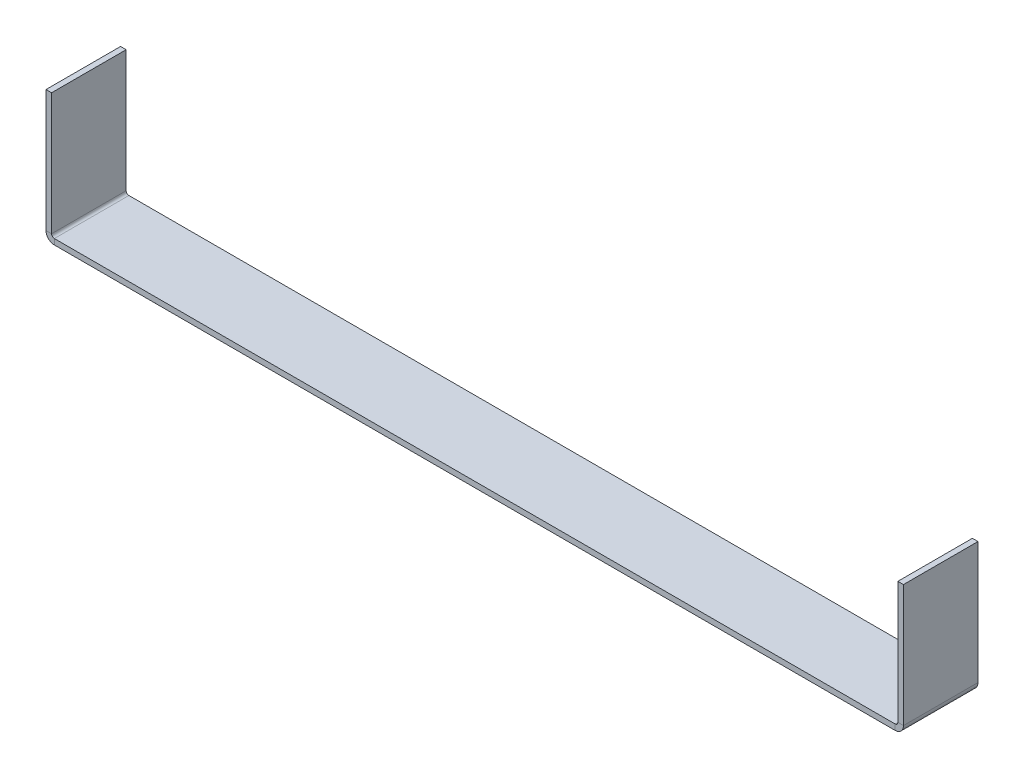
ISO-10303-21;
HEADER;
FILE_DESCRIPTION(('STEP AP214'),'2;1');
FILE_NAME('part.step','',(''),(''),'','','');
FILE_SCHEMA(('AUTOMOTIVE_DESIGN { 1 0 10303 214 1 1 1 1 }'));
ENDSEC;
DATA;
#1=APPLICATION_CONTEXT('core data for automotive mechanical design processes');
#2=APPLICATION_PROTOCOL_DEFINITION('international standard','automotive_design',2000,#1);
#3=PRODUCT_CONTEXT('',#1,'mechanical');
#4=PRODUCT('Part','Part','',(#3));
#5=PRODUCT_RELATED_PRODUCT_CATEGORY('part','',(#4));
#6=PRODUCT_DEFINITION_FORMATION('','',#4);
#7=PRODUCT_DEFINITION_CONTEXT('part definition',#1,'design');
#8=PRODUCT_DEFINITION('design','',#6,#7);
#9=PRODUCT_DEFINITION_SHAPE('','',#8);
#10=(LENGTH_UNIT() NAMED_UNIT(*) SI_UNIT(.MILLI.,.METRE.));
#11=(NAMED_UNIT(*) PLANE_ANGLE_UNIT() SI_UNIT($,.RADIAN.));
#12=(NAMED_UNIT(*) SI_UNIT($,.STERADIAN.) SOLID_ANGLE_UNIT());
#13=UNCERTAINTY_MEASURE_WITH_UNIT(LENGTH_MEASURE(1.E-05),#10,'distance_accuracy_value','');
#14=(GEOMETRIC_REPRESENTATION_CONTEXT(3) GLOBAL_UNCERTAINTY_ASSIGNED_CONTEXT((#13)) GLOBAL_UNIT_ASSIGNED_CONTEXT((#10,
#11,#12)) REPRESENTATION_CONTEXT('',''));
#15=CARTESIAN_POINT('',(0.,0.,0.));
#16=DIRECTION('',(0.,0.,1.));
#17=DIRECTION('',(1.,0.,0.));
#18=AXIS2_PLACEMENT_3D('',#15,#16,#17);
#19=CARTESIAN_POINT('',(0.,-1.5,0.));
#20=DIRECTION('',(0.,-1.,0.));
#21=DIRECTION('',(0.,0.,-1.));
#22=AXIS2_PLACEMENT_3D('',#19,#20,#21);
#23=PLANE('',#22);
#24=DIRECTION('',(-1.,0.,0.));
#25=VECTOR('',#24,1.);
#26=CARTESIAN_POINT('',(0.,-1.5,-20.));
#27=LINE('',#26,#25);
#28=CARTESIAN_POINT('',(227.7634,-1.5,-20.));
#29=VERTEX_POINT('',#28);
#30=CARTESIAN_POINT('',(2.2366,-1.5,-20.));
#31=VERTEX_POINT('',#30);
#32=EDGE_CURVE('E13',#29,#31,#27,.T.);
#33=ORIENTED_EDGE('',*,*,#32,.F.);
#34=DIRECTION('',(0.,0.,-1.));
#35=VECTOR('',#34,1.);
#36=CARTESIAN_POINT('',(227.7634,-1.5,-20.));
#37=LINE('',#36,#35);
#38=CARTESIAN_POINT('',(227.7634,-1.5,0.));
#39=VERTEX_POINT('',#38);
#40=EDGE_CURVE('E325',#29,#39,#37,.F.);
#41=ORIENTED_EDGE('',*,*,#40,.T.);
#42=DIRECTION('',(1.,0.,0.));
#43=VECTOR('',#42,1.);
#44=CARTESIAN_POINT('',(0.,-1.5,0.));
#45=LINE('',#44,#43);
#46=CARTESIAN_POINT('',(2.2366,-1.5,0.));
#47=VERTEX_POINT('',#46);
#48=EDGE_CURVE('E86',#47,#39,#45,.T.);
#49=ORIENTED_EDGE('',*,*,#48,.F.);
#50=DIRECTION('',(0.,0.,1.));
#51=VECTOR('',#50,1.);
#52=CARTESIAN_POINT('',(2.2366,-1.5,0.));
#53=LINE('',#52,#51);
#54=EDGE_CURVE('E100',#47,#31,#53,.F.);
#55=ORIENTED_EDGE('',*,*,#54,.T.);
#56=EDGE_LOOP('',(#33,#41,#49,#55));
#57=FACE_BOUND('',#56,.T.);
#58=ADVANCED_FACE('F77',(#57),#23,.T.);
#59=CARTESIAN_POINT('',(0.,0.,0.));
#60=DIRECTION('',(0.,-1.,0.));
#61=DIRECTION('',(0.,0.,-1.));
#62=AXIS2_PLACEMENT_3D('',#59,#60,#61);
#63=PLANE('',#62);
#64=DIRECTION('',(0.,0.,-1.));
#65=VECTOR('',#64,1.);
#66=CARTESIAN_POINT('',(227.7634,0.,-20.));
#67=LINE('',#66,#65);
#68=CARTESIAN_POINT('',(227.7634,0.,-20.));
#69=VERTEX_POINT('',#68);
#70=CARTESIAN_POINT('',(227.7634,0.,0.));
#71=VERTEX_POINT('',#70);
#72=EDGE_CURVE('E197',#69,#71,#67,.F.);
#73=ORIENTED_EDGE('',*,*,#72,.F.);
#74=DIRECTION('',(-1.,0.,0.));
#75=VECTOR('',#74,1.);
#76=CARTESIAN_POINT('',(0.,0.,-20.));
#77=LINE('',#76,#75);
#78=CARTESIAN_POINT('',(2.2366,0.,-20.));
#79=VERTEX_POINT('',#78);
#80=EDGE_CURVE('E81',#69,#79,#77,.T.);
#81=ORIENTED_EDGE('',*,*,#80,.T.);
#82=DIRECTION('',(0.,0.,1.));
#83=VECTOR('',#82,1.);
#84=CARTESIAN_POINT('',(2.2366,0.,0.));
#85=LINE('',#84,#83);
#86=CARTESIAN_POINT('',(2.2366,0.,0.));
#87=VERTEX_POINT('',#86);
#88=EDGE_CURVE('E144',#87,#79,#85,.F.);
#89=ORIENTED_EDGE('',*,*,#88,.F.);
#90=DIRECTION('',(1.,0.,0.));
#91=VECTOR('',#90,1.);
#92=CARTESIAN_POINT('',(0.,0.,0.));
#93=LINE('',#92,#91);
#94=EDGE_CURVE('E185',#87,#71,#93,.T.);
#95=ORIENTED_EDGE('',*,*,#94,.T.);
#96=EDGE_LOOP('',(#73,#81,#89,#95));
#97=FACE_BOUND('',#96,.T.);
#98=ADVANCED_FACE('F194',(#97),#63,.F.);
#99=CARTESIAN_POINT('',(0.,-1.5,-20.));
#100=DIRECTION('',(0.,0.,-1.));
#101=DIRECTION('',(-1.,0.,0.));
#102=AXIS2_PLACEMENT_3D('',#99,#100,#101);
#103=PLANE('',#102);
#104=ORIENTED_EDGE('',*,*,#80,.F.);
#105=DIRECTION('',(0.,-1.,0.));
#106=VECTOR('',#105,1.);
#107=CARTESIAN_POINT('',(227.7634,0.,-20.));
#108=LINE('',#107,#106);
#109=EDGE_CURVE('E331',#69,#29,#108,.T.);
#110=ORIENTED_EDGE('',*,*,#109,.T.);
#111=ORIENTED_EDGE('',*,*,#32,.T.);
#112=DIRECTION('',(0.,-1.,0.));
#113=VECTOR('',#112,1.);
#114=CARTESIAN_POINT('',(2.2366,0.,-20.));
#115=LINE('',#114,#113);
#116=EDGE_CURVE('E182',#79,#31,#115,.T.);
#117=ORIENTED_EDGE('',*,*,#116,.F.);
#118=EDGE_LOOP('',(#104,#110,#111,#117));
#119=FACE_BOUND('',#118,.T.);
#120=ADVANCED_FACE('F200',(#119),#103,.T.);
#121=CARTESIAN_POINT('',(0.,-1.5,0.));
#122=DIRECTION('',(0.,0.,1.));
#123=DIRECTION('',(1.,0.,0.));
#124=AXIS2_PLACEMENT_3D('',#121,#122,#123);
#125=PLANE('',#124);
#126=DIRECTION('',(0.,-1.,0.));
#127=VECTOR('',#126,1.);
#128=CARTESIAN_POINT('',(227.7634,0.,0.));
#129=LINE('',#128,#127);
#130=EDGE_CURVE('E173',#71,#39,#129,.T.);
#131=ORIENTED_EDGE('',*,*,#130,.F.);
#132=ORIENTED_EDGE('',*,*,#94,.F.);
#133=DIRECTION('',(0.,-1.,0.));
#134=VECTOR('',#133,1.);
#135=CARTESIAN_POINT('',(2.2366,0.,0.));
#136=LINE('',#135,#134);
#137=EDGE_CURVE('E143',#87,#47,#136,.T.);
#138=ORIENTED_EDGE('',*,*,#137,.T.);
#139=ORIENTED_EDGE('',*,*,#48,.T.);
#140=EDGE_LOOP('',(#131,#132,#138,#139));
#141=FACE_BOUND('',#140,.T.);
#142=ADVANCED_FACE('F79',(#141),#125,.T.);
#143=CARTESIAN_POINT('',(2.2366,0.7366,-20.));
#144=DIRECTION('',(0.,0.,-1.));
#145=DIRECTION('',(-1.,0.,0.));
#146=AXIS2_PLACEMENT_3D('',#143,#144,#145);
#147=PLANE('',#146);
#148=DIRECTION('',(1.,0.,0.));
#149=VECTOR('',#148,1.);
#150=CARTESIAN_POINT('',(0.,0.736599999999992,-20.));
#151=LINE('',#150,#149);
#152=CARTESIAN_POINT('',(1.5,0.736599999999997,-20.));
#153=VERTEX_POINT('',#152);
#154=CARTESIAN_POINT('',(0.,0.736599999999992,-20.));
#155=VERTEX_POINT('',#154);
#156=EDGE_CURVE('E134',#153,#155,#151,.F.);
#157=ORIENTED_EDGE('',*,*,#156,.F.);
#158=CARTESIAN_POINT('',(2.2366,0.7366,-20.));
#159=DIRECTION('',(0.,0.,1.));
#160=DIRECTION('',(1.,0.,0.));
#161=AXIS2_PLACEMENT_3D('',#158,#159,#160);
#162=CIRCLE('',#161,0.7366);
#163=EDGE_CURVE('E128',#79,#153,#162,.F.);
#164=ORIENTED_EDGE('',*,*,#163,.F.);
#165=ORIENTED_EDGE('',*,*,#116,.T.);
#166=CARTESIAN_POINT('',(2.2366,0.7366,-20.));
#167=DIRECTION('',(0.,0.,1.));
#168=DIRECTION('',(1.,0.,0.));
#169=AXIS2_PLACEMENT_3D('',#166,#167,#168);
#170=CIRCLE('',#169,2.2366);
#171=EDGE_CURVE('E175',#31,#155,#170,.F.);
#172=ORIENTED_EDGE('',*,*,#171,.T.);
#173=EDGE_LOOP('',(#157,#164,#165,#172));
#174=FACE_BOUND('',#173,.T.);
#175=ADVANCED_FACE('F199',(#174),#147,.T.);
#176=CARTESIAN_POINT('',(2.2366,0.7366,0.));
#177=DIRECTION('',(0.,0.,-1.));
#178=DIRECTION('',(-1.,0.,0.));
#179=AXIS2_PLACEMENT_3D('',#176,#177,#178);
#180=PLANE('',#179);
#181=CARTESIAN_POINT('',(2.2366,0.7366,0.));
#182=DIRECTION('',(0.,0.,1.));
#183=DIRECTION('',(1.,0.,0.));
#184=AXIS2_PLACEMENT_3D('',#181,#182,#183);
#185=CIRCLE('',#184,0.7366);
#186=CARTESIAN_POINT('',(1.5,0.736599999999997,0.));
#187=VERTEX_POINT('',#186);
#188=EDGE_CURVE('E125',#187,#87,#185,.T.);
#189=ORIENTED_EDGE('',*,*,#188,.F.);
#190=DIRECTION('',(1.,0.,0.));
#191=VECTOR('',#190,1.);
#192=CARTESIAN_POINT('',(1.5,0.736599999999997,0.));
#193=LINE('',#192,#191);
#194=CARTESIAN_POINT('',(0.,0.736599999999992,0.));
#195=VERTEX_POINT('',#194);
#196=EDGE_CURVE('E133',#187,#195,#193,.F.);
#197=ORIENTED_EDGE('',*,*,#196,.T.);
#198=CARTESIAN_POINT('',(2.2366,0.7366,0.));
#199=DIRECTION('',(0.,0.,1.));
#200=DIRECTION('',(1.,0.,0.));
#201=AXIS2_PLACEMENT_3D('',#198,#199,#200);
#202=CIRCLE('',#201,2.2366);
#203=EDGE_CURVE('E176',#195,#47,#202,.T.);
#204=ORIENTED_EDGE('',*,*,#203,.T.);
#205=ORIENTED_EDGE('',*,*,#137,.F.);
#206=EDGE_LOOP('',(#189,#197,#204,#205));
#207=FACE_BOUND('',#206,.T.);
#208=ADVANCED_FACE('F139',(#207),#180,.F.);
#209=CARTESIAN_POINT('',(2.2366,0.7366,0.));
#210=DIRECTION('',(0.,0.,1.));
#211=DIRECTION('',(-1.,0.,0.));
#212=AXIS2_PLACEMENT_3D('',#209,#210,#211);
#213=CYLINDRICAL_SURFACE('',#212,2.2366);
#214=ORIENTED_EDGE('',*,*,#54,.F.);
#215=ORIENTED_EDGE('',*,*,#203,.F.);
#216=DIRECTION('',(0.,0.,1.));
#217=VECTOR('',#216,1.);
#218=CARTESIAN_POINT('',(0.,0.736599999999992,-20.));
#219=LINE('',#218,#217);
#220=EDGE_CURVE('E157',#195,#155,#219,.F.);
#221=ORIENTED_EDGE('',*,*,#220,.T.);
#222=ORIENTED_EDGE('',*,*,#171,.F.);
#223=EDGE_LOOP('',(#214,#215,#221,#222));
#224=FACE_BOUND('',#223,.T.);
#225=ADVANCED_FACE('F216',(#224),#213,.T.);
#226=CARTESIAN_POINT('',(2.2366,0.7366,0.));
#227=DIRECTION('',(0.,0.,1.));
#228=DIRECTION('',(-1.,0.,0.));
#229=AXIS2_PLACEMENT_3D('',#226,#227,#228);
#230=CYLINDRICAL_SURFACE('',#229,0.7366);
#231=ORIENTED_EDGE('',*,*,#88,.T.);
#232=ORIENTED_EDGE('',*,*,#163,.T.);
#233=DIRECTION('',(0.,0.,1.));
#234=VECTOR('',#233,1.);
#235=CARTESIAN_POINT('',(1.5,0.736599999999997,-20.));
#236=LINE('',#235,#234);
#237=EDGE_CURVE('E121',#153,#187,#236,.T.);
#238=ORIENTED_EDGE('',*,*,#237,.T.);
#239=ORIENTED_EDGE('',*,*,#188,.T.);
#240=EDGE_LOOP('',(#231,#232,#238,#239));
#241=FACE_BOUND('',#240,.T.);
#242=ADVANCED_FACE('F124',(#241),#230,.F.);
#243=CARTESIAN_POINT('',(0.,0.,-20.));
#244=DIRECTION('',(0.,0.,1.));
#245=DIRECTION('',(1.,0.,0.));
#246=AXIS2_PLACEMENT_3D('',#243,#244,#245);
#247=PLANE('',#246);
#248=ORIENTED_EDGE('',*,*,#156,.T.);
#249=DIRECTION('',(0.,-1.,0.));
#250=VECTOR('',#249,1.);
#251=CARTESIAN_POINT('',(0.,0.,-20.));
#252=LINE('',#251,#250);
#253=CARTESIAN_POINT('',(-1.16964624851245E-13,33.5,-20.));
#254=VERTEX_POINT('',#253);
#255=EDGE_CURVE('E165',#254,#155,#252,.T.);
#256=ORIENTED_EDGE('',*,*,#255,.F.);
#257=DIRECTION('',(1.,0.,0.));
#258=VECTOR('',#257,1.);
#259=CARTESIAN_POINT('',(-1.16964624851245E-13,33.5,-20.));
#260=LINE('',#259,#258);
#261=CARTESIAN_POINT('',(1.49999999999988,33.5,-20.));
#262=VERTEX_POINT('',#261);
#263=EDGE_CURVE('E345',#254,#262,#260,.T.);
#264=ORIENTED_EDGE('',*,*,#263,.T.);
#265=DIRECTION('',(0.,1.,0.));
#266=VECTOR('',#265,1.);
#267=CARTESIAN_POINT('',(1.5,0.,-20.));
#268=LINE('',#267,#266);
#269=EDGE_CURVE('E163',#262,#153,#268,.F.);
#270=ORIENTED_EDGE('',*,*,#269,.T.);
#271=EDGE_LOOP('',(#248,#256,#264,#270));
#272=FACE_BOUND('',#271,.T.);
#273=ADVANCED_FACE('F221',(#272),#247,.F.);
#274=CARTESIAN_POINT('',(-1.16876994193937E-13,33.5,0.));
#275=DIRECTION('',(0.,0.,-1.));
#276=DIRECTION('',(-1.,0.,0.));
#277=AXIS2_PLACEMENT_3D('',#274,#275,#276);
#278=PLANE('',#277);
#279=ORIENTED_EDGE('',*,*,#196,.F.);
#280=DIRECTION('',(0.,-1.,0.));
#281=VECTOR('',#280,1.);
#282=CARTESIAN_POINT('',(1.49999999999988,33.5,0.));
#283=LINE('',#282,#281);
#284=CARTESIAN_POINT('',(1.49999999999988,33.5,0.));
#285=VERTEX_POINT('',#284);
#286=EDGE_CURVE('E153',#187,#285,#283,.F.);
#287=ORIENTED_EDGE('',*,*,#286,.T.);
#288=DIRECTION('',(1.,0.,0.));
#289=VECTOR('',#288,1.);
#290=CARTESIAN_POINT('',(-1.16876994193937E-13,33.5,0.));
#291=LINE('',#290,#289);
#292=CARTESIAN_POINT('',(-1.16964624851245E-13,33.5,0.));
#293=VERTEX_POINT('',#292);
#294=EDGE_CURVE('E145',#293,#285,#291,.T.);
#295=ORIENTED_EDGE('',*,*,#294,.F.);
#296=DIRECTION('',(0.,1.,0.));
#297=VECTOR('',#296,1.);
#298=CARTESIAN_POINT('',(0.,0.,0.));
#299=LINE('',#298,#297);
#300=EDGE_CURVE('E156',#195,#293,#299,.T.);
#301=ORIENTED_EDGE('',*,*,#300,.F.);
#302=EDGE_LOOP('',(#279,#287,#295,#301));
#303=FACE_BOUND('',#302,.T.);
#304=ADVANCED_FACE('F150',(#303),#278,.F.);
#305=CARTESIAN_POINT('',(0.,0.,0.));
#306=DIRECTION('',(1.,0.,0.));
#307=DIRECTION('',(0.,1.,0.));
#308=AXIS2_PLACEMENT_3D('',#305,#306,#307);
#309=PLANE('',#308);
#310=ORIENTED_EDGE('',*,*,#220,.F.);
#311=ORIENTED_EDGE('',*,*,#300,.T.);
#312=DIRECTION('',(0.,0.,-1.));
#313=VECTOR('',#312,1.);
#314=CARTESIAN_POINT('',(-1.16964624851245E-13,33.5,0.));
#315=LINE('',#314,#313);
#316=EDGE_CURVE('E348',#293,#254,#315,.T.);
#317=ORIENTED_EDGE('',*,*,#316,.T.);
#318=ORIENTED_EDGE('',*,*,#255,.T.);
#319=EDGE_LOOP('',(#310,#311,#317,#318));
#320=FACE_BOUND('',#319,.T.);
#321=ADVANCED_FACE('F229',(#320),#309,.F.);
#322=CARTESIAN_POINT('',(1.5,0.,0.));
#323=DIRECTION('',(1.,0.,0.));
#324=DIRECTION('',(0.,1.,0.));
#325=AXIS2_PLACEMENT_3D('',#322,#323,#324);
#326=PLANE('',#325);
#327=ORIENTED_EDGE('',*,*,#286,.F.);
#328=ORIENTED_EDGE('',*,*,#237,.F.);
#329=ORIENTED_EDGE('',*,*,#269,.F.);
#330=DIRECTION('',(0.,0.,1.));
#331=VECTOR('',#330,1.);
#332=CARTESIAN_POINT('',(1.49999999999988,33.5,-20.));
#333=LINE('',#332,#331);
#334=EDGE_CURVE('E162',#285,#262,#333,.F.);
#335=ORIENTED_EDGE('',*,*,#334,.F.);
#336=EDGE_LOOP('',(#327,#328,#329,#335));
#337=FACE_BOUND('',#336,.T.);
#338=ADVANCED_FACE('F160',(#337),#326,.T.);
#339=CARTESIAN_POINT('',(-1.16876994193937E-13,33.5,-20.));
#340=DIRECTION('',(0.,-1.,0.));
#341=DIRECTION('',(1.,0.,0.));
#342=AXIS2_PLACEMENT_3D('',#339,#340,#341);
#343=PLANE('',#342);
#344=ORIENTED_EDGE('',*,*,#334,.T.);
#345=ORIENTED_EDGE('',*,*,#263,.F.);
#346=ORIENTED_EDGE('',*,*,#316,.F.);
#347=ORIENTED_EDGE('',*,*,#294,.T.);
#348=EDGE_LOOP('',(#344,#345,#346,#347));
#349=FACE_BOUND('',#348,.T.);
#350=ADVANCED_FACE('F230',(#349),#343,.F.);
#351=CARTESIAN_POINT('',(227.7634,0.736600000000006,0.));
#352=DIRECTION('',(0.,0.,1.));
#353=DIRECTION('',(1.,0.,0.));
#354=AXIS2_PLACEMENT_3D('',#351,#352,#353);
#355=PLANE('',#354);
#356=DIRECTION('',(-1.,0.,0.));
#357=VECTOR('',#356,1.);
#358=CARTESIAN_POINT('',(230.,0.736599999999999,0.));
#359=LINE('',#358,#357);
#360=CARTESIAN_POINT('',(228.5,0.736600000000004,0.));
#361=VERTEX_POINT('',#360);
#362=CARTESIAN_POINT('',(230.,0.736599999999999,0.));
#363=VERTEX_POINT('',#362);
#364=EDGE_CURVE('E322',#361,#363,#359,.F.);
#365=ORIENTED_EDGE('',*,*,#364,.F.);
#366=CARTESIAN_POINT('',(227.7634,0.736600000000006,0.));
#367=DIRECTION('',(0.,0.,-1.));
#368=DIRECTION('',(-1.,0.,0.));
#369=AXIS2_PLACEMENT_3D('',#366,#367,#368);
#370=CIRCLE('',#369,0.736600000000004);
#371=EDGE_CURVE('E334',#71,#361,#370,.F.);
#372=ORIENTED_EDGE('',*,*,#371,.F.);
#373=ORIENTED_EDGE('',*,*,#130,.T.);
#374=CARTESIAN_POINT('',(227.7634,0.736600000000006,0.));
#375=DIRECTION('',(0.,0.,-1.));
#376=DIRECTION('',(-1.,0.,0.));
#377=AXIS2_PLACEMENT_3D('',#374,#375,#376);
#378=CIRCLE('',#377,2.2366);
#379=EDGE_CURVE('E328',#39,#363,#378,.F.);
#380=ORIENTED_EDGE('',*,*,#379,.T.);
#381=EDGE_LOOP('',(#365,#372,#373,#380));
#382=FACE_BOUND('',#381,.T.);
#383=ADVANCED_FACE('F233',(#382),#355,.T.);
#384=CARTESIAN_POINT('',(227.7634,0.736600000000006,-20.));
#385=DIRECTION('',(0.,0.,1.));
#386=DIRECTION('',(1.,0.,0.));
#387=AXIS2_PLACEMENT_3D('',#384,#385,#386);
#388=PLANE('',#387);
#389=CARTESIAN_POINT('',(227.7634,0.736600000000006,-20.));
#390=DIRECTION('',(0.,0.,-1.));
#391=DIRECTION('',(-1.,0.,0.));
#392=AXIS2_PLACEMENT_3D('',#389,#390,#391);
#393=CIRCLE('',#392,0.736600000000004);
#394=CARTESIAN_POINT('',(228.5,0.736600000000004,-20.));
#395=VERTEX_POINT('',#394);
#396=EDGE_CURVE('E338',#395,#69,#393,.T.);
#397=ORIENTED_EDGE('',*,*,#396,.F.);
#398=DIRECTION('',(-1.,0.,0.));
#399=VECTOR('',#398,1.);
#400=CARTESIAN_POINT('',(228.5,0.736600000000004,-20.));
#401=LINE('',#400,#399);
#402=CARTESIAN_POINT('',(230.,0.736599999999999,-20.));
#403=VERTEX_POINT('',#402);
#404=EDGE_CURVE('E296',#395,#403,#401,.F.);
#405=ORIENTED_EDGE('',*,*,#404,.T.);
#406=CARTESIAN_POINT('',(227.7634,0.736600000000006,-20.));
#407=DIRECTION('',(0.,0.,-1.));
#408=DIRECTION('',(-1.,0.,0.));
#409=AXIS2_PLACEMENT_3D('',#406,#407,#408);
#410=CIRCLE('',#409,2.2366);
#411=EDGE_CURVE('E329',#403,#29,#410,.T.);
#412=ORIENTED_EDGE('',*,*,#411,.T.);
#413=ORIENTED_EDGE('',*,*,#109,.F.);
#414=EDGE_LOOP('',(#397,#405,#412,#413));
#415=FACE_BOUND('',#414,.T.);
#416=ADVANCED_FACE('F240',(#415),#388,.F.);
#417=CARTESIAN_POINT('',(227.7634,0.736600000000006,-20.));
#418=DIRECTION('',(0.,0.,-1.));
#419=DIRECTION('',(1.,0.,0.));
#420=AXIS2_PLACEMENT_3D('',#417,#418,#419);
#421=CYLINDRICAL_SURFACE('',#420,2.2366);
#422=ORIENTED_EDGE('',*,*,#40,.F.);
#423=ORIENTED_EDGE('',*,*,#411,.F.);
#424=DIRECTION('',(0.,0.,-1.));
#425=VECTOR('',#424,1.);
#426=CARTESIAN_POINT('',(230.,0.736599999999999,0.));
#427=LINE('',#426,#425);
#428=EDGE_CURVE('E281',#403,#363,#427,.F.);
#429=ORIENTED_EDGE('',*,*,#428,.T.);
#430=ORIENTED_EDGE('',*,*,#379,.F.);
#431=EDGE_LOOP('',(#422,#423,#429,#430));
#432=FACE_BOUND('',#431,.T.);
#433=ADVANCED_FACE('F243',(#432),#421,.T.);
#434=CARTESIAN_POINT('',(227.7634,0.736600000000006,-20.));
#435=DIRECTION('',(0.,0.,-1.));
#436=DIRECTION('',(1.,0.,0.));
#437=AXIS2_PLACEMENT_3D('',#434,#435,#436);
#438=CYLINDRICAL_SURFACE('',#437,0.736600000000004);
#439=ORIENTED_EDGE('',*,*,#72,.T.);
#440=ORIENTED_EDGE('',*,*,#371,.T.);
#441=DIRECTION('',(0.,0.,-1.));
#442=VECTOR('',#441,1.);
#443=CARTESIAN_POINT('',(228.5,0.736600000000004,0.));
#444=LINE('',#443,#442);
#445=EDGE_CURVE('E319',#361,#395,#444,.T.);
#446=ORIENTED_EDGE('',*,*,#445,.T.);
#447=ORIENTED_EDGE('',*,*,#396,.T.);
#448=EDGE_LOOP('',(#439,#440,#446,#447));
#449=FACE_BOUND('',#448,.T.);
#450=ADVANCED_FACE('F248',(#449),#438,.F.);
#451=CARTESIAN_POINT('',(230.,33.5,-20.));
#452=DIRECTION('',(0.,0.,1.));
#453=DIRECTION('',(1.,0.,0.));
#454=AXIS2_PLACEMENT_3D('',#451,#452,#453);
#455=PLANE('',#454);
#456=ORIENTED_EDGE('',*,*,#404,.F.);
#457=DIRECTION('',(0.,-1.,0.));
#458=VECTOR('',#457,1.);
#459=CARTESIAN_POINT('',(228.5,33.5,-20.));
#460=LINE('',#459,#458);
#461=CARTESIAN_POINT('',(228.5,33.5,-20.));
#462=VERTEX_POINT('',#461);
#463=EDGE_CURVE('E295',#395,#462,#460,.F.);
#464=ORIENTED_EDGE('',*,*,#463,.T.);
#465=DIRECTION('',(-1.,0.,0.));
#466=VECTOR('',#465,1.);
#467=CARTESIAN_POINT('',(230.,33.5,-20.));
#468=LINE('',#467,#466);
#469=CARTESIAN_POINT('',(230.,33.5,-20.));
#470=VERTEX_POINT('',#469);
#471=EDGE_CURVE('E304',#470,#462,#468,.T.);
#472=ORIENTED_EDGE('',*,*,#471,.F.);
#473=DIRECTION('',(0.,1.,0.));
#474=VECTOR('',#473,1.);
#475=CARTESIAN_POINT('',(230.,-7.67479895631506E-13,-20.));
#476=LINE('',#475,#474);
#477=EDGE_CURVE('E285',#403,#470,#476,.T.);
#478=ORIENTED_EDGE('',*,*,#477,.F.);
#479=EDGE_LOOP('',(#456,#464,#472,#478));
#480=FACE_BOUND('',#479,.T.);
#481=ADVANCED_FACE('F251',(#480),#455,.F.);
#482=CARTESIAN_POINT('',(230.,0.,0.));
#483=DIRECTION('',(0.,0.,-1.));
#484=DIRECTION('',(-1.,0.,0.));
#485=AXIS2_PLACEMENT_3D('',#482,#483,#484);
#486=PLANE('',#485);
#487=ORIENTED_EDGE('',*,*,#364,.T.);
#488=DIRECTION('',(0.,-1.,0.));
#489=VECTOR('',#488,1.);
#490=CARTESIAN_POINT('',(230.,-7.67479895631506E-13,0.));
#491=LINE('',#490,#489);
#492=CARTESIAN_POINT('',(230.,33.5,0.));
#493=VERTEX_POINT('',#492);
#494=EDGE_CURVE('E289',#493,#363,#491,.T.);
#495=ORIENTED_EDGE('',*,*,#494,.F.);
#496=DIRECTION('',(-1.,0.,0.));
#497=VECTOR('',#496,1.);
#498=CARTESIAN_POINT('',(230.,33.5,0.));
#499=LINE('',#498,#497);
#500=CARTESIAN_POINT('',(228.5,33.5,0.));
#501=VERTEX_POINT('',#500);
#502=EDGE_CURVE('E384',#493,#501,#499,.T.);
#503=ORIENTED_EDGE('',*,*,#502,.T.);
#504=DIRECTION('',(0.,1.,0.));
#505=VECTOR('',#504,1.);
#506=CARTESIAN_POINT('',(228.5,0.,0.));
#507=LINE('',#506,#505);
#508=EDGE_CURVE('E307',#501,#361,#507,.F.);
#509=ORIENTED_EDGE('',*,*,#508,.T.);
#510=EDGE_LOOP('',(#487,#495,#503,#509));
#511=FACE_BOUND('',#510,.T.);
#512=ADVANCED_FACE('F258',(#511),#486,.F.);
#513=CARTESIAN_POINT('',(230.,-7.67479895631506E-13,0.));
#514=DIRECTION('',(-1.,0.,0.));
#515=DIRECTION('',(0.,-1.,0.));
#516=AXIS2_PLACEMENT_3D('',#513,#514,#515);
#517=PLANE('',#516);
#518=ORIENTED_EDGE('',*,*,#428,.F.);
#519=ORIENTED_EDGE('',*,*,#477,.T.);
#520=DIRECTION('',(0.,0.,1.));
#521=VECTOR('',#520,1.);
#522=CARTESIAN_POINT('',(230.,33.5,0.));
#523=LINE('',#522,#521);
#524=EDGE_CURVE('E306',#470,#493,#523,.T.);
#525=ORIENTED_EDGE('',*,*,#524,.T.);
#526=ORIENTED_EDGE('',*,*,#494,.T.);
#527=EDGE_LOOP('',(#518,#519,#525,#526));
#528=FACE_BOUND('',#527,.T.);
#529=ADVANCED_FACE('F267',(#528),#517,.F.);
#530=CARTESIAN_POINT('',(228.5,-7.62242673623242E-13,0.));
#531=DIRECTION('',(-1.,0.,0.));
#532=DIRECTION('',(0.,-1.,0.));
#533=AXIS2_PLACEMENT_3D('',#530,#531,#532);
#534=PLANE('',#533);
#535=ORIENTED_EDGE('',*,*,#463,.F.);
#536=ORIENTED_EDGE('',*,*,#445,.F.);
#537=ORIENTED_EDGE('',*,*,#508,.F.);
#538=DIRECTION('',(0.,0.,-1.));
#539=VECTOR('',#538,1.);
#540=CARTESIAN_POINT('',(228.5,33.5,0.));
#541=LINE('',#540,#539);
#542=EDGE_CURVE('E311',#462,#501,#541,.F.);
#543=ORIENTED_EDGE('',*,*,#542,.F.);
#544=EDGE_LOOP('',(#535,#536,#537,#543));
#545=FACE_BOUND('',#544,.T.);
#546=ADVANCED_FACE('F263',(#545),#534,.T.);
#547=CARTESIAN_POINT('',(230.,33.5,0.));
#548=DIRECTION('',(0.,-1.,0.));
#549=DIRECTION('',(1.,0.,0.));
#550=AXIS2_PLACEMENT_3D('',#547,#548,#549);
#551=PLANE('',#550);
#552=ORIENTED_EDGE('',*,*,#542,.T.);
#553=ORIENTED_EDGE('',*,*,#502,.F.);
#554=ORIENTED_EDGE('',*,*,#524,.F.);
#555=ORIENTED_EDGE('',*,*,#471,.T.);
#556=EDGE_LOOP('',(#552,#553,#554,#555));
#557=FACE_BOUND('',#556,.T.);
#558=ADVANCED_FACE('F260',(#557),#551,.F.);
#559=CLOSED_SHELL('',(#58,#98,#120,#142,#175,#208,#225,#242,#273,#304,#321,#338,#350,#383,#416,
#433,#450,#481,#512,#529,#546,#558));
#560=MANIFOLD_SOLID_BREP('B2',#559);
#561=ADVANCED_BREP_SHAPE_REPRESENTATION('',(#18,#560),#14);
#562=SHAPE_DEFINITION_REPRESENTATION(#9,#561);
ENDSEC;
END-ISO-10303-21;
